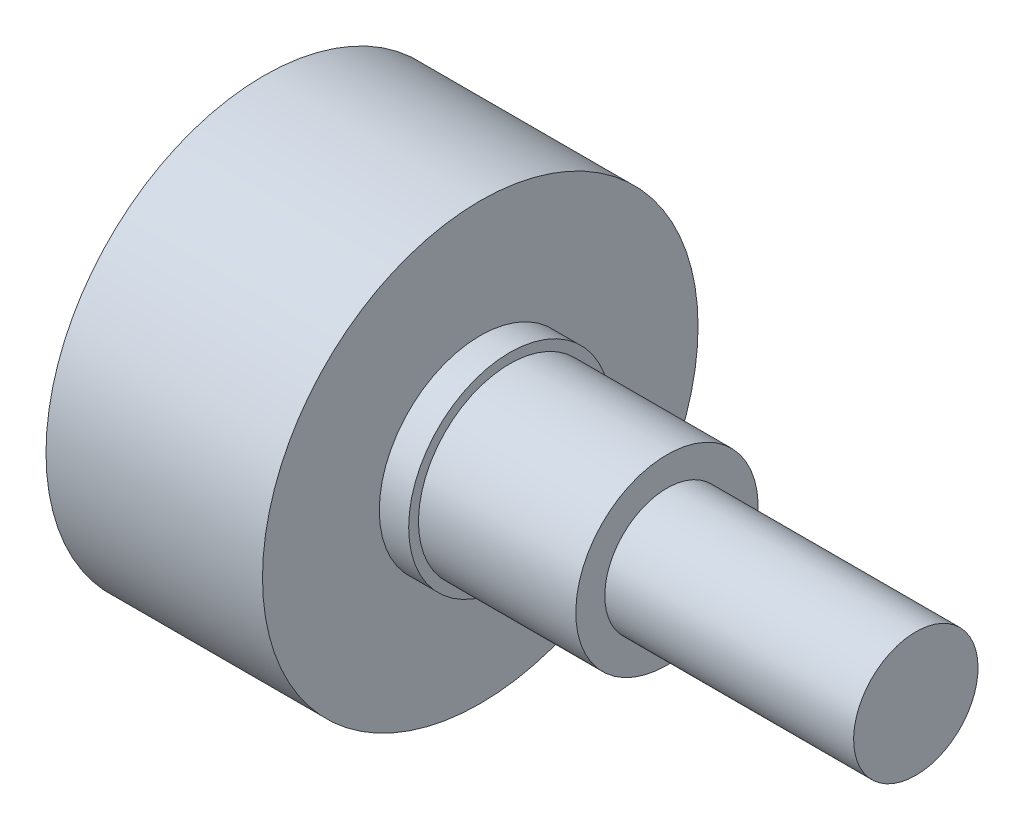
ISO-10303-21;
HEADER;
FILE_DESCRIPTION(('STEP AP214'),'2;1');
FILE_NAME('part.step','',(''),(''),'','','');
FILE_SCHEMA(('AUTOMOTIVE_DESIGN { 1 0 10303 214 1 1 1 1 }'));
ENDSEC;
DATA;
#1=APPLICATION_CONTEXT('core data for automotive mechanical design processes');
#2=APPLICATION_PROTOCOL_DEFINITION('international standard','automotive_design',2000,#1);
#3=PRODUCT_CONTEXT('',#1,'mechanical');
#4=PRODUCT('Part','Part','',(#3));
#5=PRODUCT_RELATED_PRODUCT_CATEGORY('part','',(#4));
#6=PRODUCT_DEFINITION_FORMATION('','',#4);
#7=PRODUCT_DEFINITION_CONTEXT('part definition',#1,'design');
#8=PRODUCT_DEFINITION('design','',#6,#7);
#9=PRODUCT_DEFINITION_SHAPE('','',#8);
#10=(LENGTH_UNIT() NAMED_UNIT(*) SI_UNIT(.MILLI.,.METRE.));
#11=(NAMED_UNIT(*) PLANE_ANGLE_UNIT() SI_UNIT($,.RADIAN.));
#12=(NAMED_UNIT(*) SI_UNIT($,.STERADIAN.) SOLID_ANGLE_UNIT());
#13=UNCERTAINTY_MEASURE_WITH_UNIT(LENGTH_MEASURE(1.E-05),#10,'distance_accuracy_value','');
#14=(GEOMETRIC_REPRESENTATION_CONTEXT(3) GLOBAL_UNCERTAINTY_ASSIGNED_CONTEXT((#13)) GLOBAL_UNIT_ASSIGNED_CONTEXT((#10,
#11,#12)) REPRESENTATION_CONTEXT('',''));
#15=CARTESIAN_POINT('',(0.,0.,0.));
#16=DIRECTION('',(0.,0.,1.));
#17=DIRECTION('',(1.,0.,0.));
#18=AXIS2_PLACEMENT_3D('',#15,#16,#17);
#19=CARTESIAN_POINT('',(-16.64,11.115,0.));
#20=DIRECTION('',(1.,0.,0.));
#21=DIRECTION('',(0.,1.,0.));
#22=AXIS2_PLACEMENT_3D('',#19,#20,#21);
#23=PLANE('',#22);
#24=CARTESIAN_POINT('',(-16.64,-5.525,0.));
#25=DIRECTION('',(1.,0.,0.));
#26=DIRECTION('',(0.,1.,0.));
#27=AXIS2_PLACEMENT_3D('',#24,#25,#26);
#28=CIRCLE('',#27,1.);
#29=CARTESIAN_POINT('',(-16.64,-4.525,0.));
#30=VERTEX_POINT('',#29);
#31=EDGE_CURVE('E11',#30,#30,#28,.F.);
#32=ORIENTED_EDGE('',*,*,#31,.F.);
#33=EDGE_LOOP('',(#32));
#34=FACE_BOUND('',#33,.T.);
#35=CARTESIAN_POINT('',(-16.64,3.90852913510952,3.905));
#36=DIRECTION('',(1.,0.,0.));
#37=DIRECTION('',(0.,1.,0.));
#38=AXIS2_PLACEMENT_3D('',#35,#36,#37);
#39=CIRCLE('',#38,1.);
#40=CARTESIAN_POINT('',(-16.64,4.90852913510952,3.905));
#41=VERTEX_POINT('',#40);
#42=EDGE_CURVE('E44',#41,#41,#39,.F.);
#43=ORIENTED_EDGE('',*,*,#42,.F.);
#44=EDGE_LOOP('',(#43));
#45=FACE_BOUND('',#44,.T.);
#46=CARTESIAN_POINT('',(-16.64,3.90852913510952,-3.905));
#47=DIRECTION('',(1.,0.,0.));
#48=DIRECTION('',(0.,1.,0.));
#49=AXIS2_PLACEMENT_3D('',#46,#47,#48);
#50=CIRCLE('',#49,1.);
#51=CARTESIAN_POINT('',(-16.64,4.90852913510952,-3.905));
#52=VERTEX_POINT('',#51);
#53=EDGE_CURVE('E48',#52,#52,#50,.F.);
#54=ORIENTED_EDGE('',*,*,#53,.F.);
#55=EDGE_LOOP('',(#54));
#56=FACE_BOUND('',#55,.T.);
#57=CARTESIAN_POINT('',(-16.64,0.,0.));
#58=DIRECTION('',(-1.,0.,0.));
#59=DIRECTION('',(0.,-1.,0.));
#60=AXIS2_PLACEMENT_3D('',#57,#58,#59);
#61=CIRCLE('',#60,11.115);
#62=CARTESIAN_POINT('',(-16.64,-11.115,0.));
#63=VERTEX_POINT('',#62);
#64=EDGE_CURVE('E75',#63,#63,#61,.T.);
#65=ORIENTED_EDGE('',*,*,#64,.T.);
#66=EDGE_LOOP('',(#65));
#67=FACE_BOUND('',#66,.T.);
#68=ADVANCED_FACE('F38',(#34,#45,#56,#67),#23,.F.);
#69=CARTESIAN_POINT('',(16.64,0.,0.));
#70=DIRECTION('',(-1.,0.,0.));
#71=DIRECTION('',(0.,-1.,0.));
#72=AXIS2_PLACEMENT_3D('',#69,#70,#71);
#73=PLANE('',#72);
#74=CARTESIAN_POINT('',(16.64,0.,0.));
#75=DIRECTION('',(-1.,0.,0.));
#76=DIRECTION('',(0.,-1.,0.));
#77=AXIS2_PLACEMENT_3D('',#74,#75,#76);
#78=CIRCLE('',#77,3.175);
#79=CARTESIAN_POINT('',(16.64,-3.175,0.));
#80=VERTEX_POINT('',#79);
#81=EDGE_CURVE('E52',#80,#80,#78,.T.);
#82=ORIENTED_EDGE('',*,*,#81,.F.);
#83=EDGE_LOOP('',(#82));
#84=FACE_BOUND('',#83,.T.);
#85=ADVANCED_FACE('F103',(#84),#73,.F.);
#86=CARTESIAN_POINT('',(-16.64,0.,0.));
#87=DIRECTION('',(-1.,0.,0.));
#88=DIRECTION('',(0.,-1.,0.));
#89=AXIS2_PLACEMENT_3D('',#86,#87,#88);
#90=CYLINDRICAL_SURFACE('',#89,3.175);
#91=CARTESIAN_POINT('',(3.94,0.,0.));
#92=DIRECTION('',(-1.,0.,0.));
#93=DIRECTION('',(0.,-1.,0.));
#94=AXIS2_PLACEMENT_3D('',#91,#92,#93);
#95=CIRCLE('',#94,3.175);
#96=CARTESIAN_POINT('',(3.94,-3.175,0.));
#97=VERTEX_POINT('',#96);
#98=EDGE_CURVE('E57',#97,#97,#95,.T.);
#99=ORIENTED_EDGE('',*,*,#98,.F.);
#100=EDGE_LOOP('',(#99));
#101=FACE_BOUND('',#100,.T.);
#102=ORIENTED_EDGE('',*,*,#81,.T.);
#103=EDGE_LOOP('',(#102));
#104=FACE_BOUND('',#103,.T.);
#105=ADVANCED_FACE('F108',(#101,#104),#90,.T.);
#106=CARTESIAN_POINT('',(3.94,3.175,0.));
#107=DIRECTION('',(-1.,0.,0.));
#108=DIRECTION('',(0.,-1.,0.));
#109=AXIS2_PLACEMENT_3D('',#106,#107,#108);
#110=PLANE('',#109);
#111=CARTESIAN_POINT('',(3.94,0.,0.));
#112=DIRECTION('',(-1.,0.,0.));
#113=DIRECTION('',(0.,-1.,0.));
#114=AXIS2_PLACEMENT_3D('',#111,#112,#113);
#115=CIRCLE('',#114,4.655);
#116=CARTESIAN_POINT('',(3.94,-4.655,0.));
#117=VERTEX_POINT('',#116);
#118=EDGE_CURVE('E60',#117,#117,#115,.T.);
#119=ORIENTED_EDGE('',*,*,#118,.F.);
#120=EDGE_LOOP('',(#119));
#121=FACE_BOUND('',#120,.T.);
#122=ORIENTED_EDGE('',*,*,#98,.T.);
#123=EDGE_LOOP('',(#122));
#124=FACE_BOUND('',#123,.T.);
#125=ADVANCED_FACE('F144',(#121,#124),#110,.F.);
#126=CARTESIAN_POINT('',(-16.64,0.,0.));
#127=DIRECTION('',(-1.,0.,0.));
#128=DIRECTION('',(0.,-1.,0.));
#129=AXIS2_PLACEMENT_3D('',#126,#127,#128);
#130=CYLINDRICAL_SURFACE('',#129,4.655);
#131=CARTESIAN_POINT('',(-4.09,0.,0.));
#132=DIRECTION('',(-1.,0.,0.));
#133=DIRECTION('',(0.,-1.,0.));
#134=AXIS2_PLACEMENT_3D('',#131,#132,#133);
#135=CIRCLE('',#134,4.655);
#136=CARTESIAN_POINT('',(-4.09,-4.655,0.));
#137=VERTEX_POINT('',#136);
#138=EDGE_CURVE('E63',#137,#137,#135,.T.);
#139=ORIENTED_EDGE('',*,*,#138,.F.);
#140=EDGE_LOOP('',(#139));
#141=FACE_BOUND('',#140,.T.);
#142=ORIENTED_EDGE('',*,*,#118,.T.);
#143=EDGE_LOOP('',(#142));
#144=FACE_BOUND('',#143,.T.);
#145=ADVANCED_FACE('F138',(#141,#144),#130,.T.);
#146=CARTESIAN_POINT('',(-4.09,5.155,0.));
#147=DIRECTION('',(-1.,0.,0.));
#148=DIRECTION('',(0.,-1.,0.));
#149=AXIS2_PLACEMENT_3D('',#146,#147,#148);
#150=PLANE('',#149);
#151=CARTESIAN_POINT('',(-4.09,0.,0.));
#152=DIRECTION('',(-1.,0.,0.));
#153=DIRECTION('',(0.,-1.,0.));
#154=AXIS2_PLACEMENT_3D('',#151,#152,#153);
#155=CIRCLE('',#154,5.155);
#156=CARTESIAN_POINT('',(-4.09,-5.155,0.));
#157=VERTEX_POINT('',#156);
#158=EDGE_CURVE('E66',#157,#157,#155,.T.);
#159=ORIENTED_EDGE('',*,*,#158,.F.);
#160=EDGE_LOOP('',(#159));
#161=FACE_BOUND('',#160,.T.);
#162=ORIENTED_EDGE('',*,*,#138,.T.);
#163=EDGE_LOOP('',(#162));
#164=FACE_BOUND('',#163,.T.);
#165=ADVANCED_FACE('F132',(#161,#164),#150,.F.);
#166=CARTESIAN_POINT('',(-16.64,0.,0.));
#167=DIRECTION('',(-1.,0.,0.));
#168=DIRECTION('',(0.,-1.,0.));
#169=AXIS2_PLACEMENT_3D('',#166,#167,#168);
#170=CYLINDRICAL_SURFACE('',#169,5.155);
#171=CARTESIAN_POINT('',(-5.59,0.,0.));
#172=DIRECTION('',(-1.,0.,0.));
#173=DIRECTION('',(0.,-1.,0.));
#174=AXIS2_PLACEMENT_3D('',#171,#172,#173);
#175=CIRCLE('',#174,5.155);
#176=CARTESIAN_POINT('',(-5.59,-5.155,0.));
#177=VERTEX_POINT('',#176);
#178=EDGE_CURVE('E69',#177,#177,#175,.T.);
#179=ORIENTED_EDGE('',*,*,#178,.F.);
#180=EDGE_LOOP('',(#179));
#181=FACE_BOUND('',#180,.T.);
#182=ORIENTED_EDGE('',*,*,#158,.T.);
#183=EDGE_LOOP('',(#182));
#184=FACE_BOUND('',#183,.T.);
#185=ADVANCED_FACE('F126',(#181,#184),#170,.T.);
#186=CARTESIAN_POINT('',(-5.59,11.115,0.));
#187=DIRECTION('',(-1.,0.,0.));
#188=DIRECTION('',(0.,-1.,0.));
#189=AXIS2_PLACEMENT_3D('',#186,#187,#188);
#190=PLANE('',#189);
#191=CARTESIAN_POINT('',(-5.59,0.,0.));
#192=DIRECTION('',(-1.,0.,0.));
#193=DIRECTION('',(0.,-1.,0.));
#194=AXIS2_PLACEMENT_3D('',#191,#192,#193);
#195=CIRCLE('',#194,11.115);
#196=CARTESIAN_POINT('',(-5.59,-11.115,0.));
#197=VERTEX_POINT('',#196);
#198=EDGE_CURVE('E72',#197,#197,#195,.T.);
#199=ORIENTED_EDGE('',*,*,#198,.F.);
#200=EDGE_LOOP('',(#199));
#201=FACE_BOUND('',#200,.T.);
#202=ORIENTED_EDGE('',*,*,#178,.T.);
#203=EDGE_LOOP('',(#202));
#204=FACE_BOUND('',#203,.T.);
#205=ADVANCED_FACE('F120',(#201,#204),#190,.F.);
#206=CARTESIAN_POINT('',(-16.64,0.,0.));
#207=DIRECTION('',(-1.,0.,0.));
#208=DIRECTION('',(0.,-1.,0.));
#209=AXIS2_PLACEMENT_3D('',#206,#207,#208);
#210=CYLINDRICAL_SURFACE('',#209,11.115);
#211=ORIENTED_EDGE('',*,*,#64,.F.);
#212=EDGE_LOOP('',(#211));
#213=FACE_BOUND('',#212,.T.);
#214=ORIENTED_EDGE('',*,*,#198,.T.);
#215=EDGE_LOOP('',(#214));
#216=FACE_BOUND('',#215,.T.);
#217=ADVANCED_FACE('F116',(#213,#216),#210,.T.);
#218=CARTESIAN_POINT('',(-35.4984271247462,3.90852913510952,-3.905));
#219=DIRECTION('',(1.,0.,0.));
#220=DIRECTION('',(0.,1.,0.));
#221=AXIS2_PLACEMENT_3D('',#218,#219,#220);
#222=CYLINDRICAL_SURFACE('',#221,1.);
#223=ORIENTED_EDGE('',*,*,#53,.T.);
#224=EDGE_LOOP('',(#223));
#225=FACE_BOUND('',#224,.T.);
#226=CARTESIAN_POINT('',(-19.13,3.90852913510952,-3.905));
#227=DIRECTION('',(-1.,0.,0.));
#228=DIRECTION('',(0.,-1.,0.));
#229=AXIS2_PLACEMENT_3D('',#226,#227,#228);
#230=CIRCLE('',#229,1.);
#231=CARTESIAN_POINT('',(-19.13,2.90852913510952,-3.905));
#232=VERTEX_POINT('',#231);
#233=EDGE_CURVE('E78',#232,#232,#230,.T.);
#234=ORIENTED_EDGE('',*,*,#233,.F.);
#235=EDGE_LOOP('',(#234));
#236=FACE_BOUND('',#235,.T.);
#237=ADVANCED_FACE('F119',(#225,#236),#222,.T.);
#238=CARTESIAN_POINT('',(-19.13,11.115,0.));
#239=DIRECTION('',(-1.,0.,0.));
#240=DIRECTION('',(0.,-1.,0.));
#241=AXIS2_PLACEMENT_3D('',#238,#239,#240);
#242=PLANE('',#241);
#243=ORIENTED_EDGE('',*,*,#233,.T.);
#244=EDGE_LOOP('',(#243));
#245=FACE_BOUND('',#244,.T.);
#246=ADVANCED_FACE('F160',(#245),#242,.T.);
#247=CARTESIAN_POINT('',(-35.4984271247462,3.90852913510952,3.905));
#248=DIRECTION('',(1.,0.,0.));
#249=DIRECTION('',(0.,1.,0.));
#250=AXIS2_PLACEMENT_3D('',#247,#248,#249);
#251=CYLINDRICAL_SURFACE('',#250,1.);
#252=ORIENTED_EDGE('',*,*,#42,.T.);
#253=EDGE_LOOP('',(#252));
#254=FACE_BOUND('',#253,.T.);
#255=CARTESIAN_POINT('',(-19.13,3.90852913510952,3.905));
#256=DIRECTION('',(-1.,0.,0.));
#257=DIRECTION('',(0.,-1.,0.));
#258=AXIS2_PLACEMENT_3D('',#255,#256,#257);
#259=CIRCLE('',#258,1.);
#260=CARTESIAN_POINT('',(-19.13,2.90852913510952,3.905));
#261=VERTEX_POINT('',#260);
#262=EDGE_CURVE('E81',#261,#261,#259,.T.);
#263=ORIENTED_EDGE('',*,*,#262,.F.);
#264=EDGE_LOOP('',(#263));
#265=FACE_BOUND('',#264,.T.);
#266=ADVANCED_FACE('F99',(#254,#265),#251,.T.);
#267=CARTESIAN_POINT('',(-19.13,11.115,0.));
#268=DIRECTION('',(-1.,0.,0.));
#269=DIRECTION('',(0.,-1.,0.));
#270=AXIS2_PLACEMENT_3D('',#267,#268,#269);
#271=PLANE('',#270);
#272=ORIENTED_EDGE('',*,*,#262,.T.);
#273=EDGE_LOOP('',(#272));
#274=FACE_BOUND('',#273,.T.);
#275=ADVANCED_FACE('F92',(#274),#271,.T.);
#276=CARTESIAN_POINT('',(-35.4984271247462,-5.525,0.));
#277=DIRECTION('',(1.,0.,0.));
#278=DIRECTION('',(0.,1.,0.));
#279=AXIS2_PLACEMENT_3D('',#276,#277,#278);
#280=CYLINDRICAL_SURFACE('',#279,1.);
#281=ORIENTED_EDGE('',*,*,#31,.T.);
#282=EDGE_LOOP('',(#281));
#283=FACE_BOUND('',#282,.T.);
#284=CARTESIAN_POINT('',(-19.13,-5.525,0.));
#285=DIRECTION('',(-1.,0.,0.));
#286=DIRECTION('',(0.,-1.,0.));
#287=AXIS2_PLACEMENT_3D('',#284,#285,#286);
#288=CIRCLE('',#287,1.);
#289=CARTESIAN_POINT('',(-19.13,-6.525,0.));
#290=VERTEX_POINT('',#289);
#291=EDGE_CURVE('E84',#290,#290,#288,.T.);
#292=ORIENTED_EDGE('',*,*,#291,.F.);
#293=EDGE_LOOP('',(#292));
#294=FACE_BOUND('',#293,.T.);
#295=ADVANCED_FACE('F90',(#283,#294),#280,.T.);
#296=CARTESIAN_POINT('',(-19.13,11.115,0.));
#297=DIRECTION('',(-1.,0.,0.));
#298=DIRECTION('',(0.,-1.,0.));
#299=AXIS2_PLACEMENT_3D('',#296,#297,#298);
#300=PLANE('',#299);
#301=ORIENTED_EDGE('',*,*,#291,.T.);
#302=EDGE_LOOP('',(#301));
#303=FACE_BOUND('',#302,.T.);
#304=ADVANCED_FACE('F88',(#303),#300,.T.);
#305=CLOSED_SHELL('',(#68,#85,#105,#125,#145,#165,#185,#205,#217,#237,#246,#266,#275,#295,#304));
#306=MANIFOLD_SOLID_BREP('B2',#305);
#307=ADVANCED_BREP_SHAPE_REPRESENTATION('',(#18,#306),#14);
#308=SHAPE_DEFINITION_REPRESENTATION(#9,#307);
ENDSEC;
END-ISO-10303-21;
